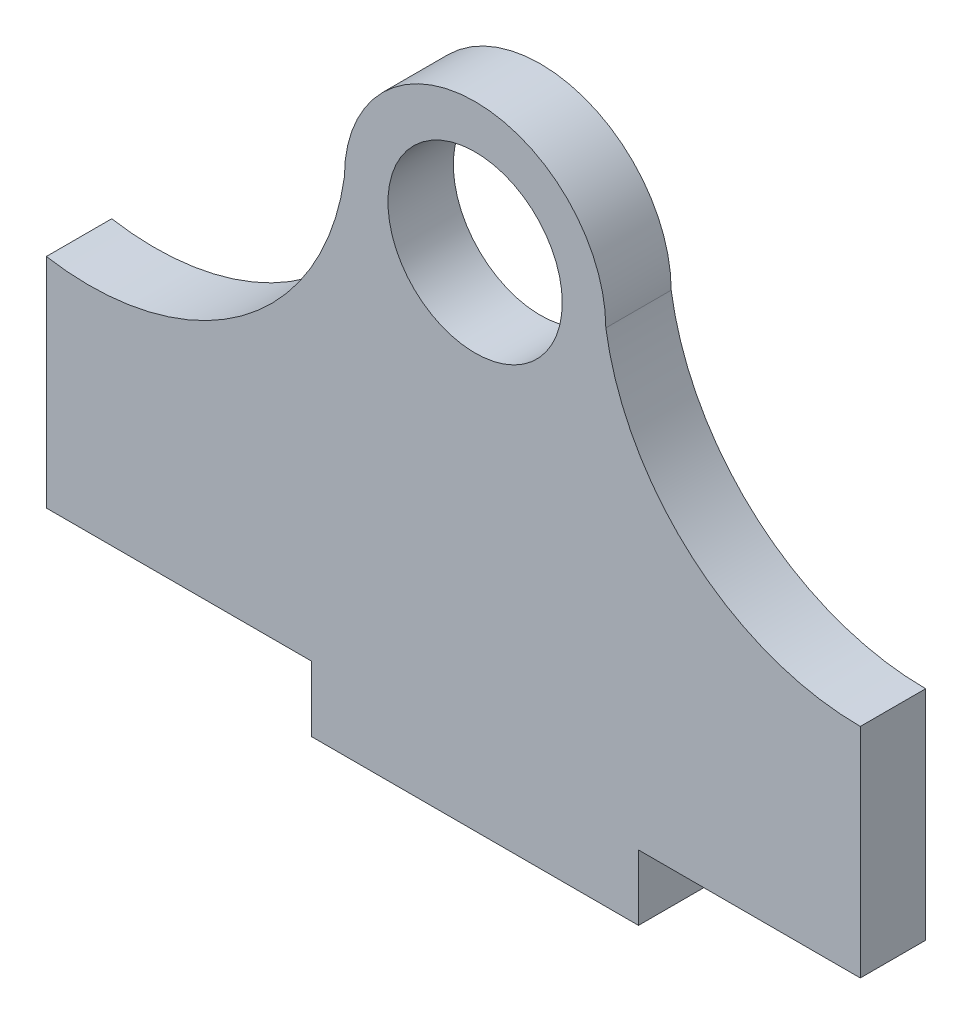
ISO-10303-21;
HEADER;
FILE_DESCRIPTION(('STEP AP214'),'2;1');
FILE_NAME('part.step','',(''),(''),'','','');
FILE_SCHEMA(('AUTOMOTIVE_DESIGN { 1 0 10303 214 1 1 1 1 }'));
ENDSEC;
DATA;
#1=APPLICATION_CONTEXT('core data for automotive mechanical design processes');
#2=APPLICATION_PROTOCOL_DEFINITION('international standard','automotive_design',2000,#1);
#3=PRODUCT_CONTEXT('',#1,'mechanical');
#4=PRODUCT('Part','Part','',(#3));
#5=PRODUCT_RELATED_PRODUCT_CATEGORY('part','',(#4));
#6=PRODUCT_DEFINITION_FORMATION('','',#4);
#7=PRODUCT_DEFINITION_CONTEXT('part definition',#1,'design');
#8=PRODUCT_DEFINITION('design','',#6,#7);
#9=PRODUCT_DEFINITION_SHAPE('','',#8);
#10=(LENGTH_UNIT() NAMED_UNIT(*) SI_UNIT(.MILLI.,.METRE.));
#11=(NAMED_UNIT(*) PLANE_ANGLE_UNIT() SI_UNIT($,.RADIAN.));
#12=(NAMED_UNIT(*) SI_UNIT($,.STERADIAN.) SOLID_ANGLE_UNIT());
#13=UNCERTAINTY_MEASURE_WITH_UNIT(LENGTH_MEASURE(1.E-05),#10,'distance_accuracy_value','');
#14=(GEOMETRIC_REPRESENTATION_CONTEXT(3) GLOBAL_UNCERTAINTY_ASSIGNED_CONTEXT((#13)) GLOBAL_UNIT_ASSIGNED_CONTEXT((#10,
#11,#12)) REPRESENTATION_CONTEXT('',''));
#15=CARTESIAN_POINT('',(0.,0.,0.));
#16=DIRECTION('',(0.,0.,1.));
#17=DIRECTION('',(1.,0.,0.));
#18=AXIS2_PLACEMENT_3D('',#15,#16,#17);
#19=CARTESIAN_POINT('',(-17.7057190361508,1.65609759406902,3.));
#20=DIRECTION('',(0.,0.,1.));
#21=DIRECTION('',(1.,0.,0.));
#22=AXIS2_PLACEMENT_3D('',#19,#20,#21);
#23=PLANE('',#22);
#24=DIRECTION('',(0.,1.,0.));
#25=VECTOR('',#24,1.);
#26=CARTESIAN_POINT('',(17.6810433821567,-10.,3.));
#27=LINE('',#26,#25);
#28=CARTESIAN_POINT('',(17.6810433821567,-20.,3.));
#29=VERTEX_POINT('',#28);
#30=CARTESIAN_POINT('',(17.6810433821567,-10.,3.));
#31=VERTEX_POINT('',#30);
#32=EDGE_CURVE('E165',#29,#31,#27,.T.);
#33=ORIENTED_EDGE('',*,*,#32,.T.);
#34=CARTESIAN_POINT('',(17.6810008203538,1.8222890081647,3.));
#35=DIRECTION('',(0.,0.,-1.));
#36=DIRECTION('',(1.,0.,0.));
#37=AXIS2_PLACEMENT_3D('',#34,#35,#36);
#38=CIRCLE('',#37,11.8222890082413);
#39=CARTESIAN_POINT('',(6.,0.,3.));
#40=VERTEX_POINT('',#39);
#41=EDGE_CURVE('E103',#31,#40,#38,.T.);
#42=ORIENTED_EDGE('',*,*,#41,.T.);
#43=CARTESIAN_POINT('',(0.,0.,3.));
#44=DIRECTION('',(0.,0.,1.));
#45=DIRECTION('',(1.,0.,0.));
#46=AXIS2_PLACEMENT_3D('',#43,#44,#45);
#47=CIRCLE('',#46,6.);
#48=CARTESIAN_POINT('',(-6.,0.,3.));
#49=VERTEX_POINT('',#48);
#50=EDGE_CURVE('E186',#40,#49,#47,.T.);
#51=ORIENTED_EDGE('',*,*,#50,.T.);
#52=CARTESIAN_POINT('',(-17.7057190361508,1.65609759406902,3.));
#53=DIRECTION('',(0.,0.,-1.));
#54=DIRECTION('',(1.,0.,0.));
#55=AXIS2_PLACEMENT_3D('',#52,#53,#54);
#56=CIRCLE('',#55,11.8222890082414);
#57=CARTESIAN_POINT('',(-19.6810433821567,-10.,3.));
#58=VERTEX_POINT('',#57);
#59=EDGE_CURVE('E205',#49,#58,#56,.T.);
#60=ORIENTED_EDGE('',*,*,#59,.T.);
#61=DIRECTION('',(0.,-1.,0.));
#62=VECTOR('',#61,1.);
#63=CARTESIAN_POINT('',(-19.6810433821567,-10.,3.));
#64=LINE('',#63,#62);
#65=CARTESIAN_POINT('',(-19.6810433821567,-20.,3.));
#66=VERTEX_POINT('',#65);
#67=EDGE_CURVE('E202',#58,#66,#64,.T.);
#68=ORIENTED_EDGE('',*,*,#67,.T.);
#69=DIRECTION('',(1.,0.,0.));
#70=VECTOR('',#69,1.);
#71=CARTESIAN_POINT('',(-19.6810433821567,-20.,3.));
#72=LINE('',#71,#70);
#73=CARTESIAN_POINT('',(-7.49999999999999,-20.,3.));
#74=VERTEX_POINT('',#73);
#75=EDGE_CURVE('E204',#66,#74,#72,.T.);
#76=ORIENTED_EDGE('',*,*,#75,.T.);
#77=DIRECTION('',(0.,-1.,0.));
#78=VECTOR('',#77,1.);
#79=CARTESIAN_POINT('',(-7.49999999999999,-23.,3.));
#80=LINE('',#79,#78);
#81=CARTESIAN_POINT('',(-7.49999999999999,-23.,3.));
#82=VERTEX_POINT('',#81);
#83=EDGE_CURVE('E128',#74,#82,#80,.T.);
#84=ORIENTED_EDGE('',*,*,#83,.T.);
#85=DIRECTION('',(1.,0.,0.));
#86=VECTOR('',#85,1.);
#87=CARTESIAN_POINT('',(-7.49999999999999,-23.,3.));
#88=LINE('',#87,#86);
#89=CARTESIAN_POINT('',(7.50000000000001,-23.,3.));
#90=VERTEX_POINT('',#89);
#91=EDGE_CURVE('E122',#82,#90,#88,.T.);
#92=ORIENTED_EDGE('',*,*,#91,.T.);
#93=DIRECTION('',(0.,1.,0.));
#94=VECTOR('',#93,1.);
#95=CARTESIAN_POINT('',(7.50000000000001,-23.,3.));
#96=LINE('',#95,#94);
#97=CARTESIAN_POINT('',(7.50000000000001,-20.,3.));
#98=VERTEX_POINT('',#97);
#99=EDGE_CURVE('E126',#90,#98,#96,.T.);
#100=ORIENTED_EDGE('',*,*,#99,.T.);
#101=DIRECTION('',(1.,0.,0.));
#102=VECTOR('',#101,1.);
#103=CARTESIAN_POINT('',(7.50000000000001,-20.,3.));
#104=LINE('',#103,#102);
#105=EDGE_CURVE('E54',#98,#29,#104,.T.);
#106=ORIENTED_EDGE('',*,*,#105,.T.);
#107=EDGE_LOOP('',(#33,#42,#51,#60,#68,#76,#84,#92,#100,#106));
#108=FACE_BOUND('',#107,.T.);
#109=CARTESIAN_POINT('',(0.,0.,3.));
#110=DIRECTION('',(0.,0.,1.));
#111=DIRECTION('',(1.,0.,0.));
#112=AXIS2_PLACEMENT_3D('',#109,#110,#111);
#113=CIRCLE('',#112,4.);
#114=CARTESIAN_POINT('',(4.,0.,3.));
#115=VERTEX_POINT('',#114);
#116=EDGE_CURVE('E150',#115,#115,#113,.T.);
#117=ORIENTED_EDGE('',*,*,#116,.F.);
#118=EDGE_LOOP('',(#117));
#119=FACE_BOUND('',#118,.T.);
#120=ADVANCED_FACE('F37',(#108,#119),#23,.T.);
#121=CARTESIAN_POINT('',(-17.7057190361508,1.65609759406902,0.));
#122=DIRECTION('',(0.,0.,1.));
#123=DIRECTION('',(1.,0.,0.));
#124=AXIS2_PLACEMENT_3D('',#121,#122,#123);
#125=PLANE('',#124);
#126=DIRECTION('',(0.,1.,0.));
#127=VECTOR('',#126,1.);
#128=CARTESIAN_POINT('',(17.6810433821567,-10.,0.));
#129=LINE('',#128,#127);
#130=CARTESIAN_POINT('',(17.6810433821567,-20.,0.));
#131=VERTEX_POINT('',#130);
#132=CARTESIAN_POINT('',(17.6810433821567,-10.,0.));
#133=VERTEX_POINT('',#132);
#134=EDGE_CURVE('E146',#131,#133,#129,.T.);
#135=ORIENTED_EDGE('',*,*,#134,.F.);
#136=DIRECTION('',(1.,0.,0.));
#137=VECTOR('',#136,1.);
#138=CARTESIAN_POINT('',(7.50000000000001,-20.,0.));
#139=LINE('',#138,#137);
#140=CARTESIAN_POINT('',(7.50000000000001,-20.,0.));
#141=VERTEX_POINT('',#140);
#142=EDGE_CURVE('E95',#141,#131,#139,.T.);
#143=ORIENTED_EDGE('',*,*,#142,.F.);
#144=DIRECTION('',(0.,1.,0.));
#145=VECTOR('',#144,1.);
#146=CARTESIAN_POINT('',(7.50000000000001,-23.,0.));
#147=LINE('',#146,#145);
#148=CARTESIAN_POINT('',(7.50000000000001,-23.,0.));
#149=VERTEX_POINT('',#148);
#150=EDGE_CURVE('E89',#149,#141,#147,.T.);
#151=ORIENTED_EDGE('',*,*,#150,.F.);
#152=DIRECTION('',(1.,0.,0.));
#153=VECTOR('',#152,1.);
#154=CARTESIAN_POINT('',(-7.49999999999999,-23.,0.));
#155=LINE('',#154,#153);
#156=CARTESIAN_POINT('',(-7.49999999999999,-23.,0.));
#157=VERTEX_POINT('',#156);
#158=EDGE_CURVE('E136',#157,#149,#155,.T.);
#159=ORIENTED_EDGE('',*,*,#158,.F.);
#160=DIRECTION('',(0.,-1.,0.));
#161=VECTOR('',#160,1.);
#162=CARTESIAN_POINT('',(-7.49999999999999,-23.,0.));
#163=LINE('',#162,#161);
#164=CARTESIAN_POINT('',(-7.49999999999999,-20.,0.));
#165=VERTEX_POINT('',#164);
#166=EDGE_CURVE('E160',#165,#157,#163,.T.);
#167=ORIENTED_EDGE('',*,*,#166,.F.);
#168=DIRECTION('',(1.,0.,0.));
#169=VECTOR('',#168,1.);
#170=CARTESIAN_POINT('',(-19.6810433821567,-20.,0.));
#171=LINE('',#170,#169);
#172=CARTESIAN_POINT('',(-19.6810433821567,-20.,0.));
#173=VERTEX_POINT('',#172);
#174=EDGE_CURVE('E158',#173,#165,#171,.T.);
#175=ORIENTED_EDGE('',*,*,#174,.F.);
#176=DIRECTION('',(0.,-1.,0.));
#177=VECTOR('',#176,1.);
#178=CARTESIAN_POINT('',(-19.6810433821567,-10.,0.));
#179=LINE('',#178,#177);
#180=CARTESIAN_POINT('',(-19.6810433821567,-10.,0.));
#181=VERTEX_POINT('',#180);
#182=EDGE_CURVE('E156',#181,#173,#179,.T.);
#183=ORIENTED_EDGE('',*,*,#182,.F.);
#184=CARTESIAN_POINT('',(-17.7057190361508,1.65609759406902,0.));
#185=DIRECTION('',(0.,0.,-1.));
#186=DIRECTION('',(1.,0.,0.));
#187=AXIS2_PLACEMENT_3D('',#184,#185,#186);
#188=CIRCLE('',#187,11.8222890082414);
#189=CARTESIAN_POINT('',(-6.,0.,0.));
#190=VERTEX_POINT('',#189);
#191=EDGE_CURVE('E154',#190,#181,#188,.T.);
#192=ORIENTED_EDGE('',*,*,#191,.F.);
#193=CARTESIAN_POINT('',(0.,0.,0.));
#194=DIRECTION('',(0.,0.,1.));
#195=DIRECTION('',(1.,0.,0.));
#196=AXIS2_PLACEMENT_3D('',#193,#194,#195);
#197=CIRCLE('',#196,6.);
#198=CARTESIAN_POINT('',(6.,0.,0.));
#199=VERTEX_POINT('',#198);
#200=EDGE_CURVE('E152',#199,#190,#197,.T.);
#201=ORIENTED_EDGE('',*,*,#200,.F.);
#202=CARTESIAN_POINT('',(17.6810008203538,1.8222890081647,0.));
#203=DIRECTION('',(0.,0.,-1.));
#204=DIRECTION('',(1.,0.,0.));
#205=AXIS2_PLACEMENT_3D('',#202,#203,#204);
#206=CIRCLE('',#205,11.8222890082413);
#207=EDGE_CURVE('E149',#133,#199,#206,.T.);
#208=ORIENTED_EDGE('',*,*,#207,.F.);
#209=EDGE_LOOP('',(#135,#143,#151,#159,#167,#175,#183,#192,#201,#208));
#210=FACE_BOUND('',#209,.T.);
#211=CARTESIAN_POINT('',(0.,0.,0.));
#212=DIRECTION('',(0.,0.,1.));
#213=DIRECTION('',(1.,0.,0.));
#214=AXIS2_PLACEMENT_3D('',#211,#212,#213);
#215=CIRCLE('',#214,4.);
#216=CARTESIAN_POINT('',(4.,0.,0.));
#217=VERTEX_POINT('',#216);
#218=EDGE_CURVE('E213',#217,#217,#215,.T.);
#219=ORIENTED_EDGE('',*,*,#218,.T.);
#220=EDGE_LOOP('',(#219));
#221=FACE_BOUND('',#220,.T.);
#222=ADVANCED_FACE('F190',(#210,#221),#125,.F.);
#223=CARTESIAN_POINT('',(17.6810433821567,-10.,3.));
#224=DIRECTION('',(-1.,0.,0.));
#225=DIRECTION('',(0.,-1.,0.));
#226=AXIS2_PLACEMENT_3D('',#223,#224,#225);
#227=PLANE('',#226);
#228=ORIENTED_EDGE('',*,*,#134,.T.);
#229=DIRECTION('',(0.,0.,-1.));
#230=VECTOR('',#229,1.);
#231=CARTESIAN_POINT('',(17.6810433821567,-10.,3.));
#232=LINE('',#231,#230);
#233=EDGE_CURVE('E11',#31,#133,#232,.T.);
#234=ORIENTED_EDGE('',*,*,#233,.F.);
#235=ORIENTED_EDGE('',*,*,#32,.F.);
#236=DIRECTION('',(0.,0.,-1.));
#237=VECTOR('',#236,1.);
#238=CARTESIAN_POINT('',(17.6810433821567,-20.,3.));
#239=LINE('',#238,#237);
#240=EDGE_CURVE('E142',#29,#131,#239,.T.);
#241=ORIENTED_EDGE('',*,*,#240,.T.);
#242=EDGE_LOOP('',(#228,#234,#235,#241));
#243=FACE_BOUND('',#242,.T.);
#244=ADVANCED_FACE('F39',(#243),#227,.F.);
#245=CARTESIAN_POINT('',(17.6810008203538,1.8222890081647,3.));
#246=DIRECTION('',(0.,0.,-1.));
#247=DIRECTION('',(-1.,0.,0.));
#248=AXIS2_PLACEMENT_3D('',#245,#246,#247);
#249=CYLINDRICAL_SURFACE('',#248,11.8222890082413);
#250=ORIENTED_EDGE('',*,*,#207,.T.);
#251=DIRECTION('',(0.,0.,-1.));
#252=VECTOR('',#251,1.);
#253=CARTESIAN_POINT('',(6.,0.,3.));
#254=LINE('',#253,#252);
#255=EDGE_CURVE('E46',#40,#199,#254,.T.);
#256=ORIENTED_EDGE('',*,*,#255,.F.);
#257=ORIENTED_EDGE('',*,*,#41,.F.);
#258=ORIENTED_EDGE('',*,*,#233,.T.);
#259=EDGE_LOOP('',(#250,#256,#257,#258));
#260=FACE_BOUND('',#259,.T.);
#261=ADVANCED_FACE('F249',(#260),#249,.F.);
#262=CARTESIAN_POINT('',(0.,0.,3.));
#263=DIRECTION('',(0.,0.,-1.));
#264=DIRECTION('',(-1.,0.,0.));
#265=AXIS2_PLACEMENT_3D('',#262,#263,#264);
#266=CYLINDRICAL_SURFACE('',#265,6.);
#267=ORIENTED_EDGE('',*,*,#200,.T.);
#268=DIRECTION('',(0.,0.,-1.));
#269=VECTOR('',#268,1.);
#270=CARTESIAN_POINT('',(-6.,0.,3.));
#271=LINE('',#270,#269);
#272=EDGE_CURVE('E178',#49,#190,#271,.T.);
#273=ORIENTED_EDGE('',*,*,#272,.F.);
#274=ORIENTED_EDGE('',*,*,#50,.F.);
#275=ORIENTED_EDGE('',*,*,#255,.T.);
#276=EDGE_LOOP('',(#267,#273,#274,#275));
#277=FACE_BOUND('',#276,.T.);
#278=ADVANCED_FACE('F184',(#277),#266,.T.);
#279=CARTESIAN_POINT('',(-17.7057190361508,1.65609759406902,3.));
#280=DIRECTION('',(0.,0.,-1.));
#281=DIRECTION('',(-1.,0.,0.));
#282=AXIS2_PLACEMENT_3D('',#279,#280,#281);
#283=CYLINDRICAL_SURFACE('',#282,11.8222890082414);
#284=ORIENTED_EDGE('',*,*,#191,.T.);
#285=DIRECTION('',(0.,0.,-1.));
#286=VECTOR('',#285,1.);
#287=CARTESIAN_POINT('',(-19.6810433821567,-10.,3.));
#288=LINE('',#287,#286);
#289=EDGE_CURVE('E175',#58,#181,#288,.T.);
#290=ORIENTED_EDGE('',*,*,#289,.F.);
#291=ORIENTED_EDGE('',*,*,#59,.F.);
#292=ORIENTED_EDGE('',*,*,#272,.T.);
#293=EDGE_LOOP('',(#284,#290,#291,#292));
#294=FACE_BOUND('',#293,.T.);
#295=ADVANCED_FACE('F196',(#294),#283,.F.);
#296=CARTESIAN_POINT('',(-19.6810433821567,-10.,3.));
#297=DIRECTION('',(1.,0.,0.));
#298=DIRECTION('',(0.,1.,0.));
#299=AXIS2_PLACEMENT_3D('',#296,#297,#298);
#300=PLANE('',#299);
#301=ORIENTED_EDGE('',*,*,#182,.T.);
#302=DIRECTION('',(0.,0.,-1.));
#303=VECTOR('',#302,1.);
#304=CARTESIAN_POINT('',(-19.6810433821567,-20.,3.));
#305=LINE('',#304,#303);
#306=EDGE_CURVE('E172',#66,#173,#305,.T.);
#307=ORIENTED_EDGE('',*,*,#306,.F.);
#308=ORIENTED_EDGE('',*,*,#67,.F.);
#309=ORIENTED_EDGE('',*,*,#289,.T.);
#310=EDGE_LOOP('',(#301,#307,#308,#309));
#311=FACE_BOUND('',#310,.T.);
#312=ADVANCED_FACE('F200',(#311),#300,.F.);
#313=CARTESIAN_POINT('',(-19.6810433821567,-20.,3.));
#314=DIRECTION('',(0.,1.,0.));
#315=DIRECTION('',(0.,0.,1.));
#316=AXIS2_PLACEMENT_3D('',#313,#314,#315);
#317=PLANE('',#316);
#318=ORIENTED_EDGE('',*,*,#174,.T.);
#319=DIRECTION('',(0.,0.,-1.));
#320=VECTOR('',#319,1.);
#321=CARTESIAN_POINT('',(-7.49999999999999,-20.,3.));
#322=LINE('',#321,#320);
#323=EDGE_CURVE('E169',#74,#165,#322,.T.);
#324=ORIENTED_EDGE('',*,*,#323,.F.);
#325=ORIENTED_EDGE('',*,*,#75,.F.);
#326=ORIENTED_EDGE('',*,*,#306,.T.);
#327=EDGE_LOOP('',(#318,#324,#325,#326));
#328=FACE_BOUND('',#327,.T.);
#329=ADVANCED_FACE('F239',(#328),#317,.F.);
#330=CARTESIAN_POINT('',(-7.49999999999999,-23.,3.));
#331=DIRECTION('',(1.,0.,0.));
#332=DIRECTION('',(0.,0.,-1.));
#333=AXIS2_PLACEMENT_3D('',#330,#331,#332);
#334=PLANE('',#333);
#335=ORIENTED_EDGE('',*,*,#166,.T.);
#336=DIRECTION('',(0.,0.,-1.));
#337=VECTOR('',#336,1.);
#338=CARTESIAN_POINT('',(-7.49999999999999,-23.,3.));
#339=LINE('',#338,#337);
#340=EDGE_CURVE('E137',#82,#157,#339,.T.);
#341=ORIENTED_EDGE('',*,*,#340,.F.);
#342=ORIENTED_EDGE('',*,*,#83,.F.);
#343=ORIENTED_EDGE('',*,*,#323,.T.);
#344=EDGE_LOOP('',(#335,#341,#342,#343));
#345=FACE_BOUND('',#344,.T.);
#346=ADVANCED_FACE('F236',(#345),#334,.F.);
#347=CARTESIAN_POINT('',(-7.49999999999999,-23.,3.));
#348=DIRECTION('',(0.,1.,0.));
#349=DIRECTION('',(0.,0.,1.));
#350=AXIS2_PLACEMENT_3D('',#347,#348,#349);
#351=PLANE('',#350);
#352=ORIENTED_EDGE('',*,*,#158,.T.);
#353=DIRECTION('',(0.,0.,-1.));
#354=VECTOR('',#353,1.);
#355=CARTESIAN_POINT('',(7.50000000000001,-23.,3.));
#356=LINE('',#355,#354);
#357=EDGE_CURVE('E133',#90,#149,#356,.T.);
#358=ORIENTED_EDGE('',*,*,#357,.F.);
#359=ORIENTED_EDGE('',*,*,#91,.F.);
#360=ORIENTED_EDGE('',*,*,#340,.T.);
#361=EDGE_LOOP('',(#352,#358,#359,#360));
#362=FACE_BOUND('',#361,.T.);
#363=ADVANCED_FACE('F134',(#362),#351,.F.);
#364=CARTESIAN_POINT('',(7.50000000000001,-23.,3.));
#365=DIRECTION('',(-1.,0.,0.));
#366=DIRECTION('',(0.,0.,1.));
#367=AXIS2_PLACEMENT_3D('',#364,#365,#366);
#368=PLANE('',#367);
#369=ORIENTED_EDGE('',*,*,#150,.T.);
#370=DIRECTION('',(0.,0.,-1.));
#371=VECTOR('',#370,1.);
#372=CARTESIAN_POINT('',(7.50000000000001,-20.,3.));
#373=LINE('',#372,#371);
#374=EDGE_CURVE('E138',#98,#141,#373,.T.);
#375=ORIENTED_EDGE('',*,*,#374,.F.);
#376=ORIENTED_EDGE('',*,*,#99,.F.);
#377=ORIENTED_EDGE('',*,*,#357,.T.);
#378=EDGE_LOOP('',(#369,#375,#376,#377));
#379=FACE_BOUND('',#378,.T.);
#380=ADVANCED_FACE('F140',(#379),#368,.F.);
#381=CARTESIAN_POINT('',(7.50000000000001,-20.,3.));
#382=DIRECTION('',(0.,1.,0.));
#383=DIRECTION('',(0.,0.,1.));
#384=AXIS2_PLACEMENT_3D('',#381,#382,#383);
#385=PLANE('',#384);
#386=ORIENTED_EDGE('',*,*,#142,.T.);
#387=ORIENTED_EDGE('',*,*,#240,.F.);
#388=ORIENTED_EDGE('',*,*,#105,.F.);
#389=ORIENTED_EDGE('',*,*,#374,.T.);
#390=EDGE_LOOP('',(#386,#387,#388,#389));
#391=FACE_BOUND('',#390,.T.);
#392=ADVANCED_FACE('F229',(#391),#385,.F.);
#393=CARTESIAN_POINT('',(0.,0.,3.));
#394=DIRECTION('',(0.,0.,-1.));
#395=DIRECTION('',(-1.,0.,0.));
#396=AXIS2_PLACEMENT_3D('',#393,#394,#395);
#397=CYLINDRICAL_SURFACE('',#396,4.);
#398=ORIENTED_EDGE('',*,*,#116,.T.);
#399=EDGE_LOOP('',(#398));
#400=FACE_BOUND('',#399,.T.);
#401=ORIENTED_EDGE('',*,*,#218,.F.);
#402=EDGE_LOOP('',(#401));
#403=FACE_BOUND('',#402,.T.);
#404=ADVANCED_FACE('F219',(#400,#403),#397,.F.);
#405=CLOSED_SHELL('',(#120,#222,#244,#261,#278,#295,#312,#329,#346,#363,#380,#392,#404));
#406=MANIFOLD_SOLID_BREP('B2',#405);
#407=ADVANCED_BREP_SHAPE_REPRESENTATION('',(#18,#406),#14);
#408=SHAPE_DEFINITION_REPRESENTATION(#9,#407);
ENDSEC;
END-ISO-10303-21;
